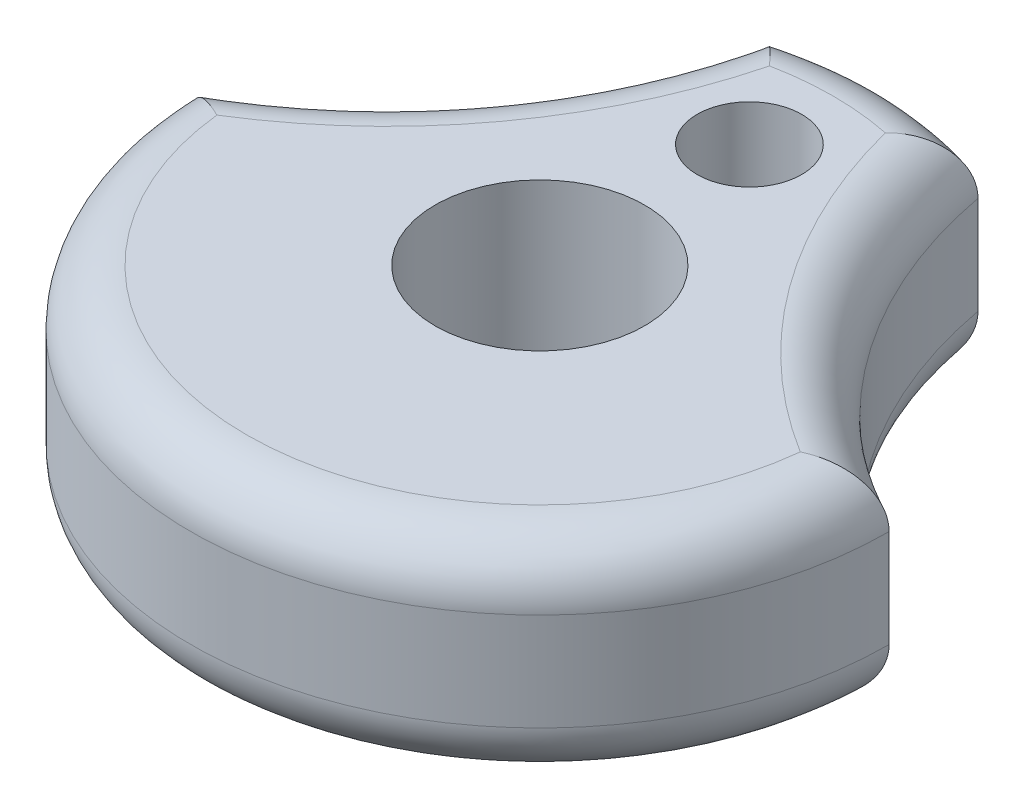
ISO-10303-21;
HEADER;
FILE_DESCRIPTION(('STEP AP214'),'2;1');
FILE_NAME('part.step','',(''),(''),'','','');
FILE_SCHEMA(('AUTOMOTIVE_DESIGN { 1 0 10303 214 1 1 1 1 }'));
ENDSEC;
DATA;
#1=APPLICATION_CONTEXT('core data for automotive mechanical design processes');
#2=APPLICATION_PROTOCOL_DEFINITION('international standard','automotive_design',2000,#1);
#3=PRODUCT_CONTEXT('',#1,'mechanical');
#4=PRODUCT('Part','Part','',(#3));
#5=PRODUCT_RELATED_PRODUCT_CATEGORY('part','',(#4));
#6=PRODUCT_DEFINITION_FORMATION('','',#4);
#7=PRODUCT_DEFINITION_CONTEXT('part definition',#1,'design');
#8=PRODUCT_DEFINITION('design','',#6,#7);
#9=PRODUCT_DEFINITION_SHAPE('','',#8);
#10=(LENGTH_UNIT() NAMED_UNIT(*) SI_UNIT(.MILLI.,.METRE.));
#11=(NAMED_UNIT(*) PLANE_ANGLE_UNIT() SI_UNIT($,.RADIAN.));
#12=(NAMED_UNIT(*) SI_UNIT($,.STERADIAN.) SOLID_ANGLE_UNIT());
#13=UNCERTAINTY_MEASURE_WITH_UNIT(LENGTH_MEASURE(1.E-05),#10,'distance_accuracy_value','');
#14=(GEOMETRIC_REPRESENTATION_CONTEXT(3) GLOBAL_UNCERTAINTY_ASSIGNED_CONTEXT((#13)) GLOBAL_UNIT_ASSIGNED_CONTEXT((#10,
#11,#12)) REPRESENTATION_CONTEXT('',''));
#15=CARTESIAN_POINT('',(0.,0.,0.));
#16=DIRECTION('',(0.,0.,1.));
#17=DIRECTION('',(1.,0.,0.));
#18=AXIS2_PLACEMENT_3D('',#15,#16,#17);
#19=CARTESIAN_POINT('',(-5.11913647129997,3.75,-3.75310628983665));
#20=DIRECTION('',(0.,1.,0.));
#21=DIRECTION('',(0.,0.,1.));
#22=AXIS2_PLACEMENT_3D('',#19,#20,#21);
#23=PLANE('',#22);
#24=CARTESIAN_POINT('',(0.,3.75,3.00845860606337E-05));
#25=DIRECTION('',(0.,1.,0.));
#26=DIRECTION('',(0.,0.,1.));
#27=AXIS2_PLACEMENT_3D('',#24,#25,#26);
#28=CIRCLE('',#27,5.25);
#29=CARTESIAN_POINT('',(-5.22003130058524,3.75,0.56018472476172));
#30=VERTEX_POINT('',#29);
#31=CARTESIAN_POINT('',(5.22003130058524,3.75,0.56018472476172));
#32=VERTEX_POINT('',#31);
#33=EDGE_CURVE('E109',#30,#32,#28,.T.);
#34=ORIENTED_EDGE('',*,*,#33,.T.);
#35=CARTESIAN_POINT('',(10.2382729425999,3.75,-7.50624266425937));
#36=DIRECTION('',(0.,1.,0.));
#37=DIRECTION('',(0.,0.,1.));
#38=AXIS2_PLACEMENT_3D('',#35,#36,#37);
#39=CIRCLE('',#38,9.5);
#40=CARTESIAN_POINT('',(1.03594830585581,3.75,-5.1467466841882));
#41=VERTEX_POINT('',#40);
#42=EDGE_CURVE('E137',#32,#41,#39,.F.);
#43=ORIENTED_EDGE('',*,*,#42,.T.);
#44=CARTESIAN_POINT('',(0.,3.75,3.00845860606337E-05));
#45=DIRECTION('',(0.,1.,0.));
#46=DIRECTION('',(0.,0.,1.));
#47=AXIS2_PLACEMENT_3D('',#44,#45,#46);
#48=CIRCLE('',#47,5.25);
#49=CARTESIAN_POINT('',(-1.03594830585581,3.75,-5.14674668418821));
#50=VERTEX_POINT('',#49);
#51=EDGE_CURVE('E112',#41,#50,#48,.T.);
#52=ORIENTED_EDGE('',*,*,#51,.T.);
#53=CARTESIAN_POINT('',(-10.2382729425999,3.75,-7.50624266425937));
#54=DIRECTION('',(0.,1.,0.));
#55=DIRECTION('',(0.,0.,1.));
#56=AXIS2_PLACEMENT_3D('',#53,#54,#55);
#57=CIRCLE('',#56,9.5);
#58=EDGE_CURVE('E104',#50,#30,#57,.F.);
#59=ORIENTED_EDGE('',*,*,#58,.T.);
#60=EDGE_LOOP('',(#34,#43,#52,#59));
#61=FACE_BOUND('',#60,.T.);
#62=CARTESIAN_POINT('',(0.,3.75,3.00845860606337E-05));
#63=DIRECTION('',(0.,1.,0.));
#64=DIRECTION('',(0.,0.,1.));
#65=AXIS2_PLACEMENT_3D('',#62,#63,#64);
#66=CIRCLE('',#65,1.875);
#67=CARTESIAN_POINT('',(0.,3.75,1.87503008458606));
#68=VERTEX_POINT('',#67);
#69=EDGE_CURVE('E256',#68,#68,#66,.T.);
#70=ORIENTED_EDGE('',*,*,#69,.F.);
#71=EDGE_LOOP('',(#70));
#72=FACE_BOUND('',#71,.T.);
#73=CARTESIAN_POINT('',(0.,3.75,-3.74996991541394));
#74=DIRECTION('',(0.,1.,0.));
#75=DIRECTION('',(0.,0.,1.));
#76=AXIS2_PLACEMENT_3D('',#73,#74,#75);
#77=CIRCLE('',#76,0.935);
#78=CARTESIAN_POINT('',(0.,3.75,-2.81496991541394));
#79=VERTEX_POINT('',#78);
#80=EDGE_CURVE('E290',#79,#79,#77,.T.);
#81=ORIENTED_EDGE('',*,*,#80,.F.);
#82=EDGE_LOOP('',(#81));
#83=FACE_BOUND('',#82,.T.);
#84=ADVANCED_FACE('F33',(#61,#72,#83),#23,.T.);
#85=CARTESIAN_POINT('',(-5.11913647129997,0.,-3.75310628983665));
#86=DIRECTION('',(0.,1.,0.));
#87=DIRECTION('',(0.,0.,1.));
#88=AXIS2_PLACEMENT_3D('',#85,#86,#87);
#89=PLANE('',#88);
#90=CARTESIAN_POINT('',(0.,0.,3.00845860606337E-05));
#91=DIRECTION('',(0.,1.,0.));
#92=DIRECTION('',(0.,0.,1.));
#93=AXIS2_PLACEMENT_3D('',#90,#91,#92);
#94=CIRCLE('',#93,5.25);
#95=CARTESIAN_POINT('',(5.22003130058524,0.,0.56018472476172));
#96=VERTEX_POINT('',#95);
#97=CARTESIAN_POINT('',(-5.22003130058524,0.,0.56018472476172));
#98=VERTEX_POINT('',#97);
#99=EDGE_CURVE('E266',#96,#98,#94,.F.);
#100=ORIENTED_EDGE('',*,*,#99,.T.);
#101=CARTESIAN_POINT('',(-10.2382729425999,0.,-7.50624266425937));
#102=DIRECTION('',(0.,1.,0.));
#103=DIRECTION('',(0.,0.,1.));
#104=AXIS2_PLACEMENT_3D('',#101,#102,#103);
#105=CIRCLE('',#104,9.5);
#106=CARTESIAN_POINT('',(-1.03594830585581,0.,-5.14674668418821));
#107=VERTEX_POINT('',#106);
#108=EDGE_CURVE('E272',#98,#107,#105,.T.);
#109=ORIENTED_EDGE('',*,*,#108,.T.);
#110=CARTESIAN_POINT('',(0.,0.,3.00845860606337E-05));
#111=DIRECTION('',(0.,1.,0.));
#112=DIRECTION('',(0.,0.,1.));
#113=AXIS2_PLACEMENT_3D('',#110,#111,#112);
#114=CIRCLE('',#113,5.25);
#115=CARTESIAN_POINT('',(1.03594830585581,0.,-5.1467466841882));
#116=VERTEX_POINT('',#115);
#117=EDGE_CURVE('E261',#107,#116,#114,.F.);
#118=ORIENTED_EDGE('',*,*,#117,.T.);
#119=CARTESIAN_POINT('',(10.2382729425999,0.,-7.50624266425937));
#120=DIRECTION('',(0.,1.,0.));
#121=DIRECTION('',(0.,0.,1.));
#122=AXIS2_PLACEMENT_3D('',#119,#120,#121);
#123=CIRCLE('',#122,9.5);
#124=EDGE_CURVE('E267',#116,#96,#123,.T.);
#125=ORIENTED_EDGE('',*,*,#124,.T.);
#126=EDGE_LOOP('',(#100,#109,#118,#125));
#127=FACE_BOUND('',#126,.T.);
#128=CARTESIAN_POINT('',(0.,0.,3.00845860606337E-05));
#129=DIRECTION('',(0.,1.,0.));
#130=DIRECTION('',(0.,0.,1.));
#131=AXIS2_PLACEMENT_3D('',#128,#129,#130);
#132=CIRCLE('',#131,1.875);
#133=CARTESIAN_POINT('',(0.,0.,1.87503008458606));
#134=VERTEX_POINT('',#133);
#135=EDGE_CURVE('E286',#134,#134,#132,.T.);
#136=ORIENTED_EDGE('',*,*,#135,.T.);
#137=EDGE_LOOP('',(#136));
#138=FACE_BOUND('',#137,.T.);
#139=CARTESIAN_POINT('',(0.,0.,-3.74996991541394));
#140=DIRECTION('',(0.,1.,0.));
#141=DIRECTION('',(0.,0.,1.));
#142=AXIS2_PLACEMENT_3D('',#139,#140,#141);
#143=CIRCLE('',#142,0.935);
#144=CARTESIAN_POINT('',(0.,0.,-2.81496991541394));
#145=VERTEX_POINT('',#144);
#146=EDGE_CURVE('E124',#145,#145,#143,.T.);
#147=ORIENTED_EDGE('',*,*,#146,.T.);
#148=EDGE_LOOP('',(#147));
#149=FACE_BOUND('',#148,.T.);
#150=ADVANCED_FACE('F223',(#127,#138,#149),#89,.F.);
#151=CARTESIAN_POINT('',(-10.2382729425999,3.75,-7.50624266425937));
#152=DIRECTION('',(0.,-1.,0.));
#153=DIRECTION('',(0.,0.,-1.));
#154=AXIS2_PLACEMENT_3D('',#151,#152,#153);
#155=CYLINDRICAL_SURFACE('',#154,8.5);
#156=DIRECTION('',(0.,-1.,0.));
#157=VECTOR('',#156,1.);
#158=CARTESIAN_POINT('',(-1.88,3.75,-5.96051519248381));
#159=LINE('',#158,#157);
#160=CARTESIAN_POINT('',(-1.88,2.75,-5.96051519248381));
#161=VERTEX_POINT('',#160);
#162=CARTESIAN_POINT('',(-1.88,1.,-5.96051519248381));
#163=VERTEX_POINT('',#162);
#164=EDGE_CURVE('E251',#161,#163,#159,.T.);
#165=ORIENTED_EDGE('',*,*,#164,.T.);
#166=CARTESIAN_POINT('',(-10.2382729425999,1.,-7.50624266425937));
#167=DIRECTION('',(0.,1.,0.));
#168=DIRECTION('',(0.,0.,1.));
#169=AXIS2_PLACEMENT_3D('',#166,#167,#168);
#170=CIRCLE('',#169,8.5);
#171=CARTESIAN_POINT('',(-6.24999999992759,1.,0.));
#172=VERTEX_POINT('',#171);
#173=EDGE_CURVE('E147',#163,#172,#170,.F.);
#174=ORIENTED_EDGE('',*,*,#173,.T.);
#175=DIRECTION('',(0.,-1.,0.));
#176=VECTOR('',#175,1.);
#177=CARTESIAN_POINT('',(-6.24999999992759,3.75,0.));
#178=LINE('',#177,#176);
#179=CARTESIAN_POINT('',(-6.24999999992759,2.75,0.));
#180=VERTEX_POINT('',#179);
#181=EDGE_CURVE('E130',#180,#172,#178,.T.);
#182=ORIENTED_EDGE('',*,*,#181,.F.);
#183=CARTESIAN_POINT('',(-10.2382729425999,2.75,-7.50624266425937));
#184=DIRECTION('',(0.,1.,0.));
#185=DIRECTION('',(0.,0.,1.));
#186=AXIS2_PLACEMENT_3D('',#183,#184,#185);
#187=CIRCLE('',#186,8.5);
#188=EDGE_CURVE('E121',#180,#161,#187,.T.);
#189=ORIENTED_EDGE('',*,*,#188,.T.);
#190=EDGE_LOOP('',(#165,#174,#182,#189));
#191=FACE_BOUND('',#190,.T.);
#192=ADVANCED_FACE('F228',(#191),#155,.F.);
#193=CARTESIAN_POINT('',(0.,3.75,3.00845860606337E-05));
#194=DIRECTION('',(0.,-1.,0.));
#195=DIRECTION('',(0.,0.,-1.));
#196=AXIS2_PLACEMENT_3D('',#193,#194,#195);
#197=CYLINDRICAL_SURFACE('',#196,6.25);
#198=ORIENTED_EDGE('',*,*,#181,.T.);
#199=CARTESIAN_POINT('',(0.,1.,3.00845860606337E-05));
#200=DIRECTION('',(0.,1.,0.));
#201=DIRECTION('',(0.,0.,1.));
#202=AXIS2_PLACEMENT_3D('',#199,#200,#201);
#203=CIRCLE('',#202,6.25);
#204=CARTESIAN_POINT('',(6.24999999992759,1.,0.));
#205=VERTEX_POINT('',#204);
#206=EDGE_CURVE('E11',#172,#205,#203,.T.);
#207=ORIENTED_EDGE('',*,*,#206,.T.);
#208=DIRECTION('',(0.,-1.,0.));
#209=VECTOR('',#208,1.);
#210=CARTESIAN_POINT('',(6.24999999992759,3.75,0.));
#211=LINE('',#210,#209);
#212=CARTESIAN_POINT('',(6.24999999992759,2.75,0.));
#213=VERTEX_POINT('',#212);
#214=EDGE_CURVE('E132',#213,#205,#211,.T.);
#215=ORIENTED_EDGE('',*,*,#214,.F.);
#216=CARTESIAN_POINT('',(0.,2.75,3.00845860606337E-05));
#217=DIRECTION('',(0.,1.,0.));
#218=DIRECTION('',(0.,0.,1.));
#219=AXIS2_PLACEMENT_3D('',#216,#217,#218);
#220=CIRCLE('',#219,6.25);
#221=EDGE_CURVE('E145',#213,#180,#220,.F.);
#222=ORIENTED_EDGE('',*,*,#221,.T.);
#223=EDGE_LOOP('',(#198,#207,#215,#222));
#224=FACE_BOUND('',#223,.T.);
#225=ADVANCED_FACE('F242',(#224),#197,.T.);
#226=CARTESIAN_POINT('',(10.2382729425999,3.75,-7.50624266425937));
#227=DIRECTION('',(0.,-1.,0.));
#228=DIRECTION('',(0.,0.,-1.));
#229=AXIS2_PLACEMENT_3D('',#226,#227,#228);
#230=CYLINDRICAL_SURFACE('',#229,8.5);
#231=ORIENTED_EDGE('',*,*,#214,.T.);
#232=CARTESIAN_POINT('',(10.2382729425999,1.,-7.50624266425937));
#233=DIRECTION('',(0.,1.,0.));
#234=DIRECTION('',(0.,0.,1.));
#235=AXIS2_PLACEMENT_3D('',#232,#233,#234);
#236=CIRCLE('',#235,8.5);
#237=CARTESIAN_POINT('',(1.88,1.,-5.96051519248381));
#238=VERTEX_POINT('',#237);
#239=EDGE_CURVE('E47',#205,#238,#236,.F.);
#240=ORIENTED_EDGE('',*,*,#239,.T.);
#241=DIRECTION('',(0.,-1.,0.));
#242=VECTOR('',#241,1.);
#243=CARTESIAN_POINT('',(1.88,3.75,-5.96051519248381));
#244=LINE('',#243,#242);
#245=CARTESIAN_POINT('',(1.88,2.75,-5.96051519248381));
#246=VERTEX_POINT('',#245);
#247=EDGE_CURVE('E255',#246,#238,#244,.T.);
#248=ORIENTED_EDGE('',*,*,#247,.F.);
#249=CARTESIAN_POINT('',(10.2382729425999,2.75,-7.50624266425937));
#250=DIRECTION('',(0.,1.,0.));
#251=DIRECTION('',(0.,0.,1.));
#252=AXIS2_PLACEMENT_3D('',#249,#250,#251);
#253=CIRCLE('',#252,8.5);
#254=EDGE_CURVE('E139',#246,#213,#253,.T.);
#255=ORIENTED_EDGE('',*,*,#254,.T.);
#256=EDGE_LOOP('',(#231,#240,#248,#255));
#257=FACE_BOUND('',#256,.T.);
#258=ADVANCED_FACE('F238',(#257),#230,.F.);
#259=CARTESIAN_POINT('',(0.,3.75,3.00845860606337E-05));
#260=DIRECTION('',(0.,-1.,0.));
#261=DIRECTION('',(0.,0.,-1.));
#262=AXIS2_PLACEMENT_3D('',#259,#260,#261);
#263=CYLINDRICAL_SURFACE('',#262,6.25);
#264=ORIENTED_EDGE('',*,*,#247,.T.);
#265=CARTESIAN_POINT('',(0.,1.,3.00845860606337E-05));
#266=DIRECTION('',(0.,1.,0.));
#267=DIRECTION('',(0.,0.,1.));
#268=AXIS2_PLACEMENT_3D('',#265,#266,#267);
#269=CIRCLE('',#268,6.25);
#270=EDGE_CURVE('E260',#238,#163,#269,.T.);
#271=ORIENTED_EDGE('',*,*,#270,.T.);
#272=ORIENTED_EDGE('',*,*,#164,.F.);
#273=CARTESIAN_POINT('',(0.,2.75,3.00845860606337E-05));
#274=DIRECTION('',(0.,1.,0.));
#275=DIRECTION('',(0.,0.,1.));
#276=AXIS2_PLACEMENT_3D('',#273,#274,#275);
#277=CIRCLE('',#276,6.25);
#278=EDGE_CURVE('E142',#161,#246,#277,.F.);
#279=ORIENTED_EDGE('',*,*,#278,.T.);
#280=EDGE_LOOP('',(#264,#271,#272,#279));
#281=FACE_BOUND('',#280,.T.);
#282=ADVANCED_FACE('F235',(#281),#263,.T.);
#283=CARTESIAN_POINT('',(0.,3.75,3.00845860606337E-05));
#284=DIRECTION('',(0.,-1.,0.));
#285=DIRECTION('',(0.,0.,-1.));
#286=AXIS2_PLACEMENT_3D('',#283,#284,#285);
#287=CYLINDRICAL_SURFACE('',#286,1.875);
#288=ORIENTED_EDGE('',*,*,#69,.T.);
#289=EDGE_LOOP('',(#288));
#290=FACE_BOUND('',#289,.T.);
#291=ORIENTED_EDGE('',*,*,#135,.F.);
#292=EDGE_LOOP('',(#291));
#293=FACE_BOUND('',#292,.T.);
#294=ADVANCED_FACE('F232',(#290,#293),#287,.F.);
#295=CARTESIAN_POINT('',(0.,3.75,-3.74996991541394));
#296=DIRECTION('',(0.,-1.,0.));
#297=DIRECTION('',(0.,0.,-1.));
#298=AXIS2_PLACEMENT_3D('',#295,#296,#297);
#299=CYLINDRICAL_SURFACE('',#298,0.935);
#300=ORIENTED_EDGE('',*,*,#80,.T.);
#301=EDGE_LOOP('',(#300));
#302=FACE_BOUND('',#301,.T.);
#303=ORIENTED_EDGE('',*,*,#146,.F.);
#304=EDGE_LOOP('',(#303));
#305=FACE_BOUND('',#304,.T.);
#306=ADVANCED_FACE('F184',(#302,#305),#299,.F.);
#307=CARTESIAN_POINT('',(-10.2382729425999,2.75,-7.50624266425937));
#308=DIRECTION('',(0.,1.,0.));
#309=DIRECTION('',(0.,0.,1.));
#310=AXIS2_PLACEMENT_3D('',#307,#308,#309);
#311=TOROIDAL_SURFACE('',#310,9.5,1.);
#312=CARTESIAN_POINT('',(-1.88,2.75,-5.96051519248381));
#313=CARTESIAN_POINT('',(-1.88000167373573,2.77524645924938,-5.96051608672852));
#314=CARTESIAN_POINT('',(-1.87916369756413,2.80047962955975,-5.95977571765297));
#315=CARTESIAN_POINT('',(-1.8758328391818,2.8507418158398,-5.95682909939096));
#316=CARTESIAN_POINT('',(-1.87334052828186,2.87577089926965,-5.95462335625905));
#317=CARTESIAN_POINT('',(-1.86345261387568,2.95005036300604,-5.94586310561374));
#318=CARTESIAN_POINT('',(-1.85364544856651,2.99876228750886,-5.93716516093601));
#319=CARTESIAN_POINT('',(-1.8281434145063,3.09321473673896,-5.91444277606586));
#320=CARTESIAN_POINT('',(-1.81245397207613,3.13895795457466,-5.90042324481706));
#321=CARTESIAN_POINT('',(-1.77594945352311,3.22654374801662,-5.86760212607017));
#322=CARTESIAN_POINT('',(-1.75512990448233,3.26838287553825,-5.84879636500594));
#323=CARTESIAN_POINT('',(-1.70802135850493,3.34948516074847,-5.80592413960217));
#324=CARTESIAN_POINT('',(-1.68149995386466,3.38849208921295,-5.78163067263827));
#325=CARTESIAN_POINT('',(-1.62476847075415,3.46078234398927,-5.72918770668966));
#326=CARTESIAN_POINT('',(-1.5945575545583,3.49406436627997,-5.70103733179349));
#327=CARTESIAN_POINT('',(-1.52713613665945,3.55869619488739,-5.63757416615898));
#328=CARTESIAN_POINT('',(-1.4895304264162,3.5891868297394,-5.60180717441994));
#329=CARTESIAN_POINT('',(-1.41195141375944,3.64230450461806,-5.52708937378082));
#330=CARTESIAN_POINT('',(-1.37197539135913,3.66492229768815,-5.4881348868961));
#331=CARTESIAN_POINT('',(-1.28370401279688,3.70546897751428,-5.40096617460026));
#332=CARTESIAN_POINT('',(-1.2351625090267,3.72191737552656,-5.35231332631762));
#333=CARTESIAN_POINT('',(-1.13776431523927,3.74399576638498,-5.25307779839868));
#334=CARTESIAN_POINT('',(-1.08890848385373,3.74964804536187,-5.20249931455444));
#335=CARTESIAN_POINT('',(-1.039006959729,3.74999469785535,-5.1499690215973));
#336=CARTESIAN_POINT('',(-1.03747737952943,3.75000000759515,-5.14835801294175));
#337=CARTESIAN_POINT('',(-1.03594830585581,3.75,-5.14674668418821));
#338=B_SPLINE_CURVE_WITH_KNOTS('',3,(#312,#313,#314,#315,#316,#317,#318,#319,#320,#321,#322,
#323,#324,#325,#326,#327,#328,#329,#330,#331,#332,#333,#334,#335,#336,#337),.UNSPECIFIED.,.F.,
.F.,(4,2,2,2,2,2,2,2,2,2,2,2,4),(0.,0.0756888038447105,0.151351482778255,0.301879981829425,
0.452269960687533,0.602791530796967,0.761337391020483,0.919919317191024,1.09978980911146,
1.27987085858636,1.49099616023068,1.70168516872763,1.70834959128237),.UNSPECIFIED.);
#339=EDGE_CURVE('E125',#161,#50,#338,.T.);
#340=ORIENTED_EDGE('',*,*,#339,.F.);
#341=ORIENTED_EDGE('',*,*,#188,.F.);
#342=CARTESIAN_POINT('',(-6.24999999992759,2.75,0.));
#343=CARTESIAN_POINT('',(-6.25000135621068,2.77524645924938,-1.32723813903973E-06));
#344=CARTESIAN_POINT('',(-6.24904321520966,2.80047962955975,0.000575141541900771));
#345=CARTESIAN_POINT('',(-6.24523115178212,2.8507418158398,0.00286541427011028));
#346=CARTESIAN_POINT('',(-6.24237788382177,2.87577089926965,0.00457882558453583));
#347=CARTESIAN_POINT('',(-6.2310490925784,2.95005036300604,0.0113737745642341));
#348=CARTESIAN_POINT('',(-6.21980401078946,2.99876228750886,0.0181104553922337));
#349=CARTESIAN_POINT('',(-6.19046303450285,3.09321473673896,0.0355966678449925));
#350=CARTESIAN_POINT('',(-6.17237345382159,3.13895795457466,0.0463425010366028));
#351=CARTESIAN_POINT('',(-6.13009193240353,3.22654374801661,0.0712840057458314));
#352=CARTESIAN_POINT('',(-6.10589466595072,3.26838287553825,0.0854826876451587));
#353=CARTESIAN_POINT('',(-6.0508378749993,3.34948516074847,0.117513806659432));
#354=CARTESIAN_POINT('',(-6.01969195349435,3.38849208921295,0.135499607026011));
#355=CARTESIAN_POINT('',(-5.95261312019452,3.46078234398927,0.173829177549828));
#356=CARTESIAN_POINT('',(-5.91667912106878,3.49406436627997,0.194173483166354));
#357=CARTESIAN_POINT('',(-5.83587496463137,3.55869619488739,0.239383098142412));
#358=CARTESIAN_POINT('',(-5.79045276404668,3.5891868297394,0.264488691841889));
#359=CARTESIAN_POINT('',(-5.69585983159655,3.64230450461806,0.316000147535084));
#360=CARTESIAN_POINT('',(-5.64668477391922,3.66492229768815,0.342407497228546));
#361=CARTESIAN_POINT('',(-5.53700133323421,3.70546897751428,0.400370964309899));
#362=CARTESIAN_POINT('',(-5.47600060048321,3.72191737552656,0.432029894142182));
#363=CARTESIAN_POINT('',(-5.35206387006515,3.74399576638498,0.495067858954576));
#364=CARTESIAN_POINT('',(-5.28913213215002,3.74964804536187,0.526447337142316));
#365=CARTESIAN_POINT('',(-5.22402443637882,3.74999469785535,0.558236985449587));
#366=CARTESIAN_POINT('',(-5.22202794493862,3.75000000759515,0.559211144781696));
#367=CARTESIAN_POINT('',(-5.22003130058525,3.75,0.560184724761721));
#368=B_SPLINE_CURVE_WITH_KNOTS('',3,(#342,#343,#344,#345,#346,#347,#348,#349,#350,#351,#352,
#353,#354,#355,#356,#357,#358,#359,#360,#361,#362,#363,#364,#365,#366,#367),.UNSPECIFIED.,.F.,
.F.,(4,2,2,2,2,2,2,2,2,2,2,2,4),(0.,0.0756888038447105,0.151351482778254,0.301879981829424,
0.452269960687532,0.602791530796967,0.761337391020484,0.919919317191023,1.09978980911146,
1.27987085858636,1.49099616023068,1.70168516872763,1.70834959128237),.UNSPECIFIED.);
#369=EDGE_CURVE('E119',#30,#180,#368,.F.);
#370=ORIENTED_EDGE('',*,*,#369,.F.);
#371=ORIENTED_EDGE('',*,*,#58,.F.);
#372=EDGE_LOOP('',(#340,#341,#370,#371));
#373=FACE_BOUND('',#372,.T.);
#374=ADVANCED_FACE('F120',(#373),#311,.T.);
#375=CARTESIAN_POINT('',(0.,2.75,3.00845860606337E-05));
#376=DIRECTION('',(0.,1.,0.));
#377=DIRECTION('',(0.,0.,1.));
#378=AXIS2_PLACEMENT_3D('',#375,#376,#377);
#379=TOROIDAL_SURFACE('',#378,5.25,1.);
#380=ORIENTED_EDGE('',*,*,#369,.T.);
#381=ORIENTED_EDGE('',*,*,#221,.F.);
#382=CARTESIAN_POINT('',(6.24999999992759,2.75,0.));
#383=CARTESIAN_POINT('',(6.25000135621068,2.77524645924938,-1.32723813901531E-06));
#384=CARTESIAN_POINT('',(6.24904321520966,2.80047962955975,0.000575141541900104));
#385=CARTESIAN_POINT('',(6.24523115178212,2.8507418158398,0.00286541427010946));
#386=CARTESIAN_POINT('',(6.24237788382177,2.87577089926965,0.00457882558453556));
#387=CARTESIAN_POINT('',(6.2310490925784,2.95005036300604,0.0113737745642343));
#388=CARTESIAN_POINT('',(6.21980401078946,2.99876228750886,0.0181104553922329));
#389=CARTESIAN_POINT('',(6.19046303450285,3.09321473673896,0.0355966678449923));
#390=CARTESIAN_POINT('',(6.17237345382159,3.13895795457466,0.0463425010366044));
#391=CARTESIAN_POINT('',(6.13009193240353,3.22654374801661,0.0712840057458334));
#392=CARTESIAN_POINT('',(6.10589466595072,3.26838287553825,0.0854826876451594));
#393=CARTESIAN_POINT('',(6.0508378749993,3.34948516074847,0.11751380665943));
#394=CARTESIAN_POINT('',(6.01969195349434,3.38849208921295,0.135499607026009));
#395=CARTESIAN_POINT('',(5.95261312019452,3.46078234398927,0.173829177549828));
#396=CARTESIAN_POINT('',(5.91667912106878,3.49406436627997,0.194173483166356));
#397=CARTESIAN_POINT('',(5.83587496463137,3.55869619488739,0.239383098142415));
#398=CARTESIAN_POINT('',(5.79045276404668,3.5891868297394,0.26448869184189));
#399=CARTESIAN_POINT('',(5.69585983159655,3.64230450461806,0.316000147535082));
#400=CARTESIAN_POINT('',(5.64668477391922,3.66492229768815,0.342407497228541));
#401=CARTESIAN_POINT('',(5.53700133323421,3.70546897751428,0.400370964309901));
#402=CARTESIAN_POINT('',(5.47600060048322,3.72191737552656,0.432029894142196));
#403=CARTESIAN_POINT('',(5.35206387006514,3.74399576638498,0.495067858954563));
#404=CARTESIAN_POINT('',(5.28913213214999,3.74964804536187,0.526447337142262));
#405=CARTESIAN_POINT('',(5.22402443637882,3.74999469785535,0.558236985449584));
#406=CARTESIAN_POINT('',(5.22202794493861,3.75000000759515,0.559211144781695));
#407=CARTESIAN_POINT('',(5.22003130058525,3.75,0.560184724761721));
#408=B_SPLINE_CURVE_WITH_KNOTS('',3,(#382,#383,#384,#385,#386,#387,#388,#389,#390,#391,#392,
#393,#394,#395,#396,#397,#398,#399,#400,#401,#402,#403,#404,#405,#406,#407),.UNSPECIFIED.,.F.,
.F.,(4,2,2,2,2,2,2,2,2,2,2,2,4),(0.,0.07568880384471,0.151351482778254,0.301879981829424,
0.452269960687533,0.602791530796967,0.761337391020483,0.919919317191022,1.09978980911146,
1.27987085858636,1.49099616023068,1.70168516872763,1.70834959128237),.UNSPECIFIED.);
#409=EDGE_CURVE('E128',#32,#213,#408,.F.);
#410=ORIENTED_EDGE('',*,*,#409,.F.);
#411=ORIENTED_EDGE('',*,*,#33,.F.);
#412=EDGE_LOOP('',(#380,#381,#410,#411));
#413=FACE_BOUND('',#412,.T.);
#414=ADVANCED_FACE('F127',(#413),#379,.T.);
#415=CARTESIAN_POINT('',(0.,2.75,3.00845860606337E-05));
#416=DIRECTION('',(0.,1.,0.));
#417=DIRECTION('',(0.,0.,1.));
#418=AXIS2_PLACEMENT_3D('',#415,#416,#417);
#419=TOROIDAL_SURFACE('',#418,5.25,1.);
#420=ORIENTED_EDGE('',*,*,#339,.T.);
#421=ORIENTED_EDGE('',*,*,#51,.F.);
#422=CARTESIAN_POINT('',(1.88,2.75,-5.96051519248381));
#423=CARTESIAN_POINT('',(1.88000167373573,2.77524645924938,-5.96051608672852));
#424=CARTESIAN_POINT('',(1.87916369756413,2.80047962955975,-5.95977571765297));
#425=CARTESIAN_POINT('',(1.8758328391818,2.8507418158398,-5.95682909939096));
#426=CARTESIAN_POINT('',(1.87334052828186,2.87577089926965,-5.95462335625905));
#427=CARTESIAN_POINT('',(1.86345261387568,2.95005036300604,-5.94586310561374));
#428=CARTESIAN_POINT('',(1.85364544856651,2.99876228750887,-5.93716516093601));
#429=CARTESIAN_POINT('',(1.82814341450631,3.09321473673896,-5.91444277606586));
#430=CARTESIAN_POINT('',(1.81245397207614,3.13895795457466,-5.90042324481706));
#431=CARTESIAN_POINT('',(1.77594945352311,3.22654374801662,-5.86760212607016));
#432=CARTESIAN_POINT('',(1.75512990448233,3.26838287553825,-5.84879636500594));
#433=CARTESIAN_POINT('',(1.70802135850493,3.34948516074847,-5.80592413960218));
#434=CARTESIAN_POINT('',(1.68149995386466,3.38849208921295,-5.78163067263827));
#435=CARTESIAN_POINT('',(1.62476847075415,3.46078234398927,-5.72918770668966));
#436=CARTESIAN_POINT('',(1.5945575545583,3.49406436627997,-5.70103733179349));
#437=CARTESIAN_POINT('',(1.52713613665945,3.55869619488739,-5.63757416615898));
#438=CARTESIAN_POINT('',(1.48953042641621,3.5891868297394,-5.60180717441994));
#439=CARTESIAN_POINT('',(1.41195141375943,3.64230450461806,-5.52708937378083));
#440=CARTESIAN_POINT('',(1.37197539135911,3.66492229768815,-5.48813488689612));
#441=CARTESIAN_POINT('',(1.2837040127969,3.70546897751428,-5.40096617460024));
#442=CARTESIAN_POINT('',(1.23516250902677,3.72191737552656,-5.35231332631755));
#443=CARTESIAN_POINT('',(1.13776431523919,3.74399576638499,-5.25307779839874));
#444=CARTESIAN_POINT('',(1.08890848385346,3.74964804536187,-5.20249931455469));
#445=CARTESIAN_POINT('',(1.03900695972898,3.74999469785535,-5.14996902159731));
#446=CARTESIAN_POINT('',(1.03747737952942,3.75000000759515,-5.14835801294176));
#447=CARTESIAN_POINT('',(1.03594830585581,3.75,-5.14674668418821));
#448=B_SPLINE_CURVE_WITH_KNOTS('',3,(#422,#423,#424,#425,#426,#427,#428,#429,#430,#431,#432,
#433,#434,#435,#436,#437,#438,#439,#440,#441,#442,#443,#444,#445,#446,#447),.UNSPECIFIED.,.F.,
.F.,(4,2,2,2,2,2,2,2,2,2,2,2,4),(0.,0.0756888038447104,0.151351482778255,0.301879981829425,
0.452269960687534,0.602791530796968,0.761337391020486,0.919919317191024,1.09978980911146,
1.27987085858636,1.49099616023069,1.70168516872763,1.70834959128237),.UNSPECIFIED.);
#449=EDGE_CURVE('E148',#246,#41,#448,.T.);
#450=ORIENTED_EDGE('',*,*,#449,.F.);
#451=ORIENTED_EDGE('',*,*,#278,.F.);
#452=EDGE_LOOP('',(#420,#421,#450,#451));
#453=FACE_BOUND('',#452,.T.);
#454=ADVANCED_FACE('F165',(#453),#419,.T.);
#455=CARTESIAN_POINT('',(10.2382729425999,2.75,-7.50624266425937));
#456=DIRECTION('',(0.,1.,0.));
#457=DIRECTION('',(0.,0.,1.));
#458=AXIS2_PLACEMENT_3D('',#455,#456,#457);
#459=TOROIDAL_SURFACE('',#458,9.5,1.);
#460=ORIENTED_EDGE('',*,*,#409,.T.);
#461=ORIENTED_EDGE('',*,*,#254,.F.);
#462=ORIENTED_EDGE('',*,*,#449,.T.);
#463=ORIENTED_EDGE('',*,*,#42,.F.);
#464=EDGE_LOOP('',(#460,#461,#462,#463));
#465=FACE_BOUND('',#464,.T.);
#466=ADVANCED_FACE('F162',(#465),#459,.T.);
#467=CARTESIAN_POINT('',(10.2382729425999,1.,-7.50624266425937));
#468=DIRECTION('',(0.,1.,0.));
#469=DIRECTION('',(0.,0.,1.));
#470=AXIS2_PLACEMENT_3D('',#467,#468,#469);
#471=TOROIDAL_SURFACE('',#470,9.5,1.);
#472=CARTESIAN_POINT('',(6.24999999992759,1.,0.));
#473=CARTESIAN_POINT('',(6.25000135621068,0.974753540750616,-1.32723813891413E-06));
#474=CARTESIAN_POINT('',(6.24904321520966,0.949520370440254,0.000575141541900234));
#475=CARTESIAN_POINT('',(6.24523115178212,0.899258184160198,0.00286541427010954));
#476=CARTESIAN_POINT('',(6.24237788382177,0.874229100730353,0.00457882558453555));
#477=CARTESIAN_POINT('',(6.2310490925784,0.799949636993963,0.011373774564234));
#478=CARTESIAN_POINT('',(6.21980401078946,0.751237712491135,0.0181104553922321));
#479=CARTESIAN_POINT('',(6.19046303450285,0.656785263261038,0.0355966678449909));
#480=CARTESIAN_POINT('',(6.17237345382159,0.611042045425341,0.0463425010366028));
#481=CARTESIAN_POINT('',(6.13009193240353,0.523456251983386,0.0712840057458318));
#482=CARTESIAN_POINT('',(6.10589466595072,0.481617124461754,0.0854826876451581));
#483=CARTESIAN_POINT('',(6.0508378749993,0.400514839251527,0.117513806659431));
#484=CARTESIAN_POINT('',(6.01969195349435,0.361507910787053,0.13549960702601));
#485=CARTESIAN_POINT('',(5.95261312019452,0.289217656010729,0.17382917754983));
#486=CARTESIAN_POINT('',(5.91667912106878,0.25593563372003,0.194173483166356));
#487=CARTESIAN_POINT('',(5.83587496463137,0.191303805112608,0.239383098142415));
#488=CARTESIAN_POINT('',(5.79045276404668,0.160813170260603,0.26448869184189));
#489=CARTESIAN_POINT('',(5.69585983159655,0.107695495381936,0.316000147535083));
#490=CARTESIAN_POINT('',(5.64668477391922,0.0850777023118505,0.342407497228546));
#491=CARTESIAN_POINT('',(5.53700133323421,0.0445310224857231,0.400370964309899));
#492=CARTESIAN_POINT('',(5.47600060048321,0.028082624473442,0.432029894142182));
#493=CARTESIAN_POINT('',(5.35206387006515,0.00600423361501482,0.495067858954577));
#494=CARTESIAN_POINT('',(5.28913213215002,0.0003519546381277,0.526447337142316));
#495=CARTESIAN_POINT('',(5.22402443637882,5.30214464838463E-06,0.558236985449587));
#496=CARTESIAN_POINT('',(5.22202794493862,-7.59515473864579E-09,0.559211144781696));
#497=CARTESIAN_POINT('',(5.22003130058525,0.,0.560184724761721));
#498=B_SPLINE_CURVE_WITH_KNOTS('',3,(#472,#473,#474,#475,#476,#477,#478,#479,#480,#481,#482,
#483,#484,#485,#486,#487,#488,#489,#490,#491,#492,#493,#494,#495,#496,#497),.UNSPECIFIED.,.F.,
.F.,(4,2,2,2,2,2,2,2,2,2,2,2,4),(0.,0.0756888038447102,0.151351482778254,0.301879981829424,
0.452269960687532,0.602791530796966,0.761337391020483,0.919919317191023,1.09978980911146,
1.27987085858636,1.49099616023068,1.70168516872763,1.70834959128237),.UNSPECIFIED.);
#499=EDGE_CURVE('E202',#96,#205,#498,.F.);
#500=ORIENTED_EDGE('',*,*,#499,.F.);
#501=ORIENTED_EDGE('',*,*,#124,.F.);
#502=CARTESIAN_POINT('',(1.88,1.,-5.96051519248381));
#503=CARTESIAN_POINT('',(1.88000167373573,0.974753540750616,-5.96051608672852));
#504=CARTESIAN_POINT('',(1.87916369756413,0.949520370440254,-5.95977571765297));
#505=CARTESIAN_POINT('',(1.8758328391818,0.899258184160198,-5.95682909939096));
#506=CARTESIAN_POINT('',(1.87334052828186,0.874229100730352,-5.95462335625905));
#507=CARTESIAN_POINT('',(1.86345261387568,0.799949636993962,-5.94586310561374));
#508=CARTESIAN_POINT('',(1.85364544856651,0.751237712491135,-5.93716516093601));
#509=CARTESIAN_POINT('',(1.82814341450631,0.656785263261037,-5.91444277606586));
#510=CARTESIAN_POINT('',(1.81245397207614,0.61104204542534,-5.90042324481706));
#511=CARTESIAN_POINT('',(1.77594945352311,0.523456251983384,-5.86760212607016));
#512=CARTESIAN_POINT('',(1.75512990448233,0.481617124461752,-5.84879636500593));
#513=CARTESIAN_POINT('',(1.70802135850493,0.400514839251526,-5.80592413960217));
#514=CARTESIAN_POINT('',(1.68149995386466,0.361507910787051,-5.78163067263827));
#515=CARTESIAN_POINT('',(1.62476847075415,0.289217656010727,-5.72918770668966));
#516=CARTESIAN_POINT('',(1.5945575545583,0.255935633720029,-5.70103733179349));
#517=CARTESIAN_POINT('',(1.52713613665945,0.191303805112607,-5.63757416615898));
#518=CARTESIAN_POINT('',(1.48953042641621,0.160813170260602,-5.60180717441994));
#519=CARTESIAN_POINT('',(1.41195141375943,0.107695495381935,-5.52708937378083));
#520=CARTESIAN_POINT('',(1.37197539135911,0.0850777023118494,-5.48813488689612));
#521=CARTESIAN_POINT('',(1.2837040127969,0.0445310224857221,-5.40096617460024));
#522=CARTESIAN_POINT('',(1.23516250902677,0.0280826244734408,-5.35231332631755));
#523=CARTESIAN_POINT('',(1.1377643152392,0.00600423361501505,-5.25307779839874));
#524=CARTESIAN_POINT('',(1.08890848385348,0.000351954638129138,-5.20249931455468));
#525=CARTESIAN_POINT('',(1.03900695972898,5.30214464847166E-06,-5.14996902159731));
#526=CARTESIAN_POINT('',(1.03747737952942,-7.5951546954636E-09,-5.14835801294176));
#527=CARTESIAN_POINT('',(1.03594830585581,0.,-5.1467466841882));
#528=B_SPLINE_CURVE_WITH_KNOTS('',3,(#502,#503,#504,#505,#506,#507,#508,#509,#510,#511,#512,
#513,#514,#515,#516,#517,#518,#519,#520,#521,#522,#523,#524,#525,#526,#527),.UNSPECIFIED.,.F.,
.F.,(4,2,2,2,2,2,2,2,2,2,2,2,4),(0.,0.0756888038447106,0.151351482778254,0.301879981829424,
0.452269960687533,0.602791530796967,0.761337391020485,0.919919317191025,1.09978980911146,
1.27987085858636,1.49099616023069,1.70168516872763,1.70834959128237),.UNSPECIFIED.);
#529=EDGE_CURVE('E38',#238,#116,#528,.T.);
#530=ORIENTED_EDGE('',*,*,#529,.F.);
#531=ORIENTED_EDGE('',*,*,#239,.F.);
#532=EDGE_LOOP('',(#500,#501,#530,#531));
#533=FACE_BOUND('',#532,.T.);
#534=ADVANCED_FACE('F35',(#533),#471,.T.);
#535=CARTESIAN_POINT('',(0.,1.,3.00845860606337E-05));
#536=DIRECTION('',(0.,1.,0.));
#537=DIRECTION('',(0.,0.,1.));
#538=AXIS2_PLACEMENT_3D('',#535,#536,#537);
#539=TOROIDAL_SURFACE('',#538,5.25,1.);
#540=ORIENTED_EDGE('',*,*,#529,.T.);
#541=ORIENTED_EDGE('',*,*,#117,.F.);
#542=CARTESIAN_POINT('',(-1.88,1.,-5.96051519248381));
#543=CARTESIAN_POINT('',(-1.88000167373573,0.974753540750616,-5.96051608672852));
#544=CARTESIAN_POINT('',(-1.87916369756413,0.949520370440254,-5.95977571765297));
#545=CARTESIAN_POINT('',(-1.8758328391818,0.899258184160198,-5.95682909939096));
#546=CARTESIAN_POINT('',(-1.87334052828186,0.874229100730352,-5.95462335625905));
#547=CARTESIAN_POINT('',(-1.86345261387568,0.799949636993962,-5.94586310561374));
#548=CARTESIAN_POINT('',(-1.85364544856651,0.751237712491135,-5.93716516093601));
#549=CARTESIAN_POINT('',(-1.8281434145063,0.656785263261038,-5.91444277606586));
#550=CARTESIAN_POINT('',(-1.81245397207614,0.61104204542534,-5.90042324481706));
#551=CARTESIAN_POINT('',(-1.77594945352311,0.523456251983385,-5.86760212607016));
#552=CARTESIAN_POINT('',(-1.75512990448233,0.481617124461753,-5.84879636500593));
#553=CARTESIAN_POINT('',(-1.70802135850493,0.400514839251526,-5.80592413960217));
#554=CARTESIAN_POINT('',(-1.68149995386466,0.361507910787051,-5.78163067263827));
#555=CARTESIAN_POINT('',(-1.62476847075415,0.289217656010727,-5.72918770668966));
#556=CARTESIAN_POINT('',(-1.5945575545583,0.255935633720029,-5.70103733179349));
#557=CARTESIAN_POINT('',(-1.52713613665944,0.191303805112607,-5.63757416615898));
#558=CARTESIAN_POINT('',(-1.4895304264162,0.160813170260602,-5.60180717441994));
#559=CARTESIAN_POINT('',(-1.41195141375944,0.107695495381935,-5.52708937378082));
#560=CARTESIAN_POINT('',(-1.37197539135913,0.0850777023118497,-5.4881348868961));
#561=CARTESIAN_POINT('',(-1.28370401279688,0.0445310224857229,-5.40096617460026));
#562=CARTESIAN_POINT('',(-1.23516250902671,0.0280826244734419,-5.35231332631762));
#563=CARTESIAN_POINT('',(-1.13776431523927,0.00600423361501511,-5.25307779839868));
#564=CARTESIAN_POINT('',(-1.08890848385373,0.000351954638128582,-5.20249931455444));
#565=CARTESIAN_POINT('',(-1.039006959729,5.30214464843893E-06,-5.1499690215973));
#566=CARTESIAN_POINT('',(-1.03747737952943,-7.59515471111058E-09,-5.14835801294175));
#567=CARTESIAN_POINT('',(-1.03594830585581,0.,-5.14674668418821));
#568=B_SPLINE_CURVE_WITH_KNOTS('',3,(#542,#543,#544,#545,#546,#547,#548,#549,#550,#551,#552,
#553,#554,#555,#556,#557,#558,#559,#560,#561,#562,#563,#564,#565,#566,#567),.UNSPECIFIED.,.F.,
.F.,(4,2,2,2,2,2,2,2,2,2,2,2,4),(0.,0.0756888038447105,0.151351482778254,0.301879981829424,
0.452269960687533,0.602791530796967,0.761337391020484,0.919919317191024,1.09978980911146,
1.27987085858636,1.49099616023068,1.70168516872763,1.70834959128237),.UNSPECIFIED.);
#569=EDGE_CURVE('E208',#163,#107,#568,.T.);
#570=ORIENTED_EDGE('',*,*,#569,.F.);
#571=ORIENTED_EDGE('',*,*,#270,.F.);
#572=EDGE_LOOP('',(#540,#541,#570,#571));
#573=FACE_BOUND('',#572,.T.);
#574=ADVANCED_FACE('F191',(#573),#539,.T.);
#575=CARTESIAN_POINT('',(0.,1.,3.00845860606337E-05));
#576=DIRECTION('',(0.,1.,0.));
#577=DIRECTION('',(0.,0.,1.));
#578=AXIS2_PLACEMENT_3D('',#575,#576,#577);
#579=TOROIDAL_SURFACE('',#578,5.25,1.);
#580=ORIENTED_EDGE('',*,*,#499,.T.);
#581=ORIENTED_EDGE('',*,*,#206,.F.);
#582=CARTESIAN_POINT('',(-6.24999999992759,1.,0.));
#583=CARTESIAN_POINT('',(-6.25000135621068,0.974753540750616,-1.32723813917838E-06));
#584=CARTESIAN_POINT('',(-6.24904321520966,0.949520370440254,0.000575141541900518));
#585=CARTESIAN_POINT('',(-6.24523115178212,0.899258184160198,0.00286541427010986));
#586=CARTESIAN_POINT('',(-6.24237788382177,0.874229100730353,0.00457882558453536));
#587=CARTESIAN_POINT('',(-6.2310490925784,0.799949636993963,0.0113737745642336));
#588=CARTESIAN_POINT('',(-6.21980401078946,0.751237712491135,0.0181104553922334));
#589=CARTESIAN_POINT('',(-6.19046303450285,0.656785263261038,0.0355966678449928));
#590=CARTESIAN_POINT('',(-6.17237345382159,0.61104204542534,0.0463425010366036));
#591=CARTESIAN_POINT('',(-6.13009193240353,0.523456251983385,0.0712840057458309));
#592=CARTESIAN_POINT('',(-6.10589466595072,0.481617124461753,0.0854826876451565));
#593=CARTESIAN_POINT('',(-6.0508378749993,0.400514839251526,0.117513806659429));
#594=CARTESIAN_POINT('',(-6.01969195349435,0.361507910787052,0.13549960702601));
#595=CARTESIAN_POINT('',(-5.95261312019452,0.289217656010728,0.173829177549829));
#596=CARTESIAN_POINT('',(-5.91667912106878,0.255935633720029,0.194173483166354));
#597=CARTESIAN_POINT('',(-5.83587496463137,0.191303805112607,0.239383098142412));
#598=CARTESIAN_POINT('',(-5.79045276404668,0.160813170260602,0.26448869184189));
#599=CARTESIAN_POINT('',(-5.69585983159655,0.107695495381935,0.316000147535082));
#600=CARTESIAN_POINT('',(-5.64668477391922,0.0850777023118498,0.34240749722854));
#601=CARTESIAN_POINT('',(-5.53700133323421,0.0445310224857229,0.400370964309907));
#602=CARTESIAN_POINT('',(-5.47600060048322,0.0280826244734418,0.432029894142211));
#603=CARTESIAN_POINT('',(-5.35206387006514,0.00600423361501481,0.495067858954549));
#604=CARTESIAN_POINT('',(-5.28913213214997,0.000351954638127907,0.526447337142211));
#605=CARTESIAN_POINT('',(-5.22402443637882,5.30214464839871E-06,0.558236985449581));
#606=CARTESIAN_POINT('',(-5.22202794493861,-7.59515473091934E-09,0.559211144781693));
#607=CARTESIAN_POINT('',(-5.22003130058525,0.,0.560184724761721));
#608=B_SPLINE_CURVE_WITH_KNOTS('',3,(#582,#583,#584,#585,#586,#587,#588,#589,#590,#591,#592,
#593,#594,#595,#596,#597,#598,#599,#600,#601,#602,#603,#604,#605,#606,#607),.UNSPECIFIED.,.F.,
.F.,(4,2,2,2,2,2,2,2,2,2,2,2,4),(0.,0.0756888038447104,0.151351482778254,0.301879981829424,
0.452269960687533,0.602791530796967,0.761337391020483,0.919919317191023,1.09978980911146,
1.27987085858636,1.49099616023068,1.70168516872763,1.70834959128237),.UNSPECIFIED.);
#609=EDGE_CURVE('E196',#98,#172,#608,.F.);
#610=ORIENTED_EDGE('',*,*,#609,.F.);
#611=ORIENTED_EDGE('',*,*,#99,.F.);
#612=EDGE_LOOP('',(#580,#581,#610,#611));
#613=FACE_BOUND('',#612,.T.);
#614=ADVANCED_FACE('F185',(#613),#579,.T.);
#615=CARTESIAN_POINT('',(-10.2382729425999,1.,-7.50624266425937));
#616=DIRECTION('',(0.,1.,0.));
#617=DIRECTION('',(0.,0.,1.));
#618=AXIS2_PLACEMENT_3D('',#615,#616,#617);
#619=TOROIDAL_SURFACE('',#618,9.5,1.);
#620=ORIENTED_EDGE('',*,*,#569,.T.);
#621=ORIENTED_EDGE('',*,*,#108,.F.);
#622=ORIENTED_EDGE('',*,*,#609,.T.);
#623=ORIENTED_EDGE('',*,*,#173,.F.);
#624=EDGE_LOOP('',(#620,#621,#622,#623));
#625=FACE_BOUND('',#624,.T.);
#626=ADVANCED_FACE('F190',(#625),#619,.T.);
#627=CLOSED_SHELL('',(#84,#150,#192,#225,#258,#282,#294,#306,#374,#414,#454,#466,#534,#574,#614,#626));
#628=MANIFOLD_SOLID_BREP('B2',#627);
#629=ADVANCED_BREP_SHAPE_REPRESENTATION('',(#18,#628),#14);
#630=SHAPE_DEFINITION_REPRESENTATION(#9,#629);
ENDSEC;
END-ISO-10303-21;
